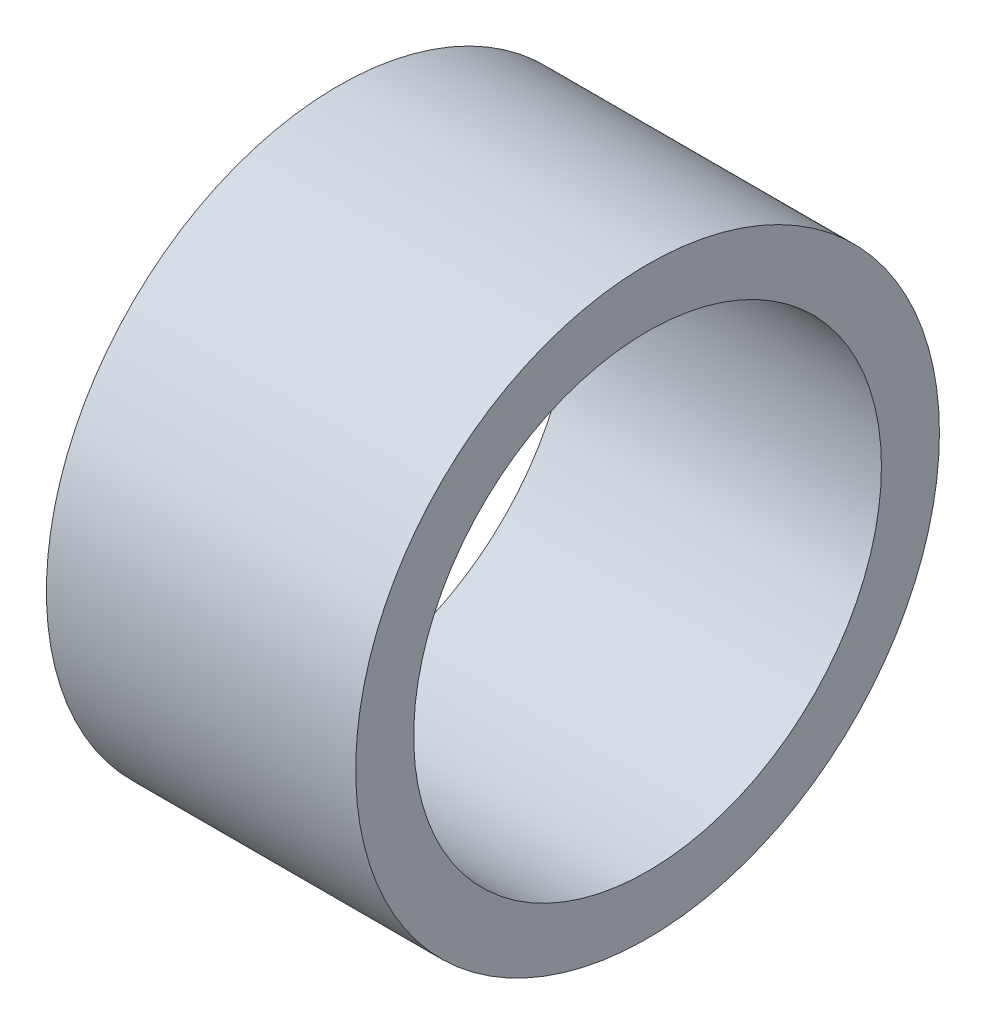
ISO-10303-21;
HEADER;
FILE_DESCRIPTION(('STEP AP214'),'2;1');
FILE_NAME('part.step','',(''),(''),'','','');
FILE_SCHEMA(('AUTOMOTIVE_DESIGN { 1 0 10303 214 1 1 1 1 }'));
ENDSEC;
DATA;
#1=APPLICATION_CONTEXT('core data for automotive mechanical design processes');
#2=APPLICATION_PROTOCOL_DEFINITION('international standard','automotive_design',2000,#1);
#3=PRODUCT_CONTEXT('',#1,'mechanical');
#4=PRODUCT('Part','Part','',(#3));
#5=PRODUCT_RELATED_PRODUCT_CATEGORY('part','',(#4));
#6=PRODUCT_DEFINITION_FORMATION('','',#4);
#7=PRODUCT_DEFINITION_CONTEXT('part definition',#1,'design');
#8=PRODUCT_DEFINITION('design','',#6,#7);
#9=PRODUCT_DEFINITION_SHAPE('','',#8);
#10=(LENGTH_UNIT() NAMED_UNIT(*) SI_UNIT(.MILLI.,.METRE.));
#11=(NAMED_UNIT(*) PLANE_ANGLE_UNIT() SI_UNIT($,.RADIAN.));
#12=(NAMED_UNIT(*) SI_UNIT($,.STERADIAN.) SOLID_ANGLE_UNIT());
#13=UNCERTAINTY_MEASURE_WITH_UNIT(LENGTH_MEASURE(1.E-05),#10,'distance_accuracy_value','');
#14=(GEOMETRIC_REPRESENTATION_CONTEXT(3) GLOBAL_UNCERTAINTY_ASSIGNED_CONTEXT((#13)) GLOBAL_UNIT_ASSIGNED_CONTEXT((#10,
#11,#12)) REPRESENTATION_CONTEXT('',''));
#15=CARTESIAN_POINT('',(0.,0.,0.));
#16=DIRECTION('',(0.,0.,1.));
#17=DIRECTION('',(1.,0.,0.));
#18=AXIS2_PLACEMENT_3D('',#15,#16,#17);
#19=CARTESIAN_POINT('',(8.,0.,0.));
#20=DIRECTION('',(1.,0.,0.));
#21=DIRECTION('',(0.,0.,-1.));
#22=AXIS2_PLACEMENT_3D('',#19,#20,#21);
#23=PLANE('',#22);
#24=CARTESIAN_POINT('',(8.,0.,0.));
#25=DIRECTION('',(1.,0.,0.));
#26=DIRECTION('',(0.,0.,-1.));
#27=AXIS2_PLACEMENT_3D('',#24,#25,#26);
#28=CIRCLE('',#27,7.55);
#29=CARTESIAN_POINT('',(8.,0.,-7.55));
#30=VERTEX_POINT('',#29);
#31=EDGE_CURVE('E10',#30,#30,#28,.T.);
#32=ORIENTED_EDGE('',*,*,#31,.T.);
#33=EDGE_LOOP('',(#32));
#34=FACE_BOUND('',#33,.T.);
#35=CARTESIAN_POINT('',(8.,0.,0.));
#36=DIRECTION('',(1.,0.,0.));
#37=DIRECTION('',(0.,0.,-1.));
#38=AXIS2_PLACEMENT_3D('',#35,#36,#37);
#39=CIRCLE('',#38,6.05);
#40=CARTESIAN_POINT('',(8.,0.,-6.05));
#41=VERTEX_POINT('',#40);
#42=EDGE_CURVE('E48',#41,#41,#39,.T.);
#43=ORIENTED_EDGE('',*,*,#42,.F.);
#44=EDGE_LOOP('',(#43));
#45=FACE_BOUND('',#44,.T.);
#46=ADVANCED_FACE('F37',(#34,#45),#23,.T.);
#47=CARTESIAN_POINT('',(0.,0.,0.));
#48=DIRECTION('',(1.,0.,0.));
#49=DIRECTION('',(0.,0.,-1.));
#50=AXIS2_PLACEMENT_3D('',#47,#48,#49);
#51=PLANE('',#50);
#52=CARTESIAN_POINT('',(0.,0.,0.));
#53=DIRECTION('',(1.,0.,0.));
#54=DIRECTION('',(0.,0.,-1.));
#55=AXIS2_PLACEMENT_3D('',#52,#53,#54);
#56=CIRCLE('',#55,7.55);
#57=CARTESIAN_POINT('',(0.,0.,-7.55));
#58=VERTEX_POINT('',#57);
#59=EDGE_CURVE('E41',#58,#58,#56,.T.);
#60=ORIENTED_EDGE('',*,*,#59,.F.);
#61=EDGE_LOOP('',(#60));
#62=FACE_BOUND('',#61,.T.);
#63=CARTESIAN_POINT('',(0.,0.,0.));
#64=DIRECTION('',(1.,0.,0.));
#65=DIRECTION('',(0.,0.,-1.));
#66=AXIS2_PLACEMENT_3D('',#63,#64,#65);
#67=CIRCLE('',#66,6.05);
#68=CARTESIAN_POINT('',(0.,0.,-6.05));
#69=VERTEX_POINT('',#68);
#70=EDGE_CURVE('E50',#69,#69,#67,.T.);
#71=ORIENTED_EDGE('',*,*,#70,.T.);
#72=EDGE_LOOP('',(#71));
#73=FACE_BOUND('',#72,.T.);
#74=ADVANCED_FACE('F60',(#62,#73),#51,.F.);
#75=CARTESIAN_POINT('',(8.,0.,0.));
#76=DIRECTION('',(-1.,0.,0.));
#77=DIRECTION('',(0.,0.,1.));
#78=AXIS2_PLACEMENT_3D('',#75,#76,#77);
#79=CYLINDRICAL_SURFACE('',#78,7.55);
#80=ORIENTED_EDGE('',*,*,#31,.F.);
#81=EDGE_LOOP('',(#80));
#82=FACE_BOUND('',#81,.T.);
#83=ORIENTED_EDGE('',*,*,#59,.T.);
#84=EDGE_LOOP('',(#83));
#85=FACE_BOUND('',#84,.T.);
#86=ADVANCED_FACE('F39',(#82,#85),#79,.T.);
#87=CARTESIAN_POINT('',(8.,0.,0.));
#88=DIRECTION('',(-1.,0.,0.));
#89=DIRECTION('',(0.,0.,1.));
#90=AXIS2_PLACEMENT_3D('',#87,#88,#89);
#91=CYLINDRICAL_SURFACE('',#90,6.05);
#92=ORIENTED_EDGE('',*,*,#42,.T.);
#93=EDGE_LOOP('',(#92));
#94=FACE_BOUND('',#93,.T.);
#95=ORIENTED_EDGE('',*,*,#70,.F.);
#96=EDGE_LOOP('',(#95));
#97=FACE_BOUND('',#96,.T.);
#98=ADVANCED_FACE('F56',(#94,#97),#91,.F.);
#99=CLOSED_SHELL('',(#46,#74,#86,#98));
#100=MANIFOLD_SOLID_BREP('B2',#99);
#101=ADVANCED_BREP_SHAPE_REPRESENTATION('',(#18,#100),#14);
#102=SHAPE_DEFINITION_REPRESENTATION(#9,#101);
ENDSEC;
END-ISO-10303-21;
